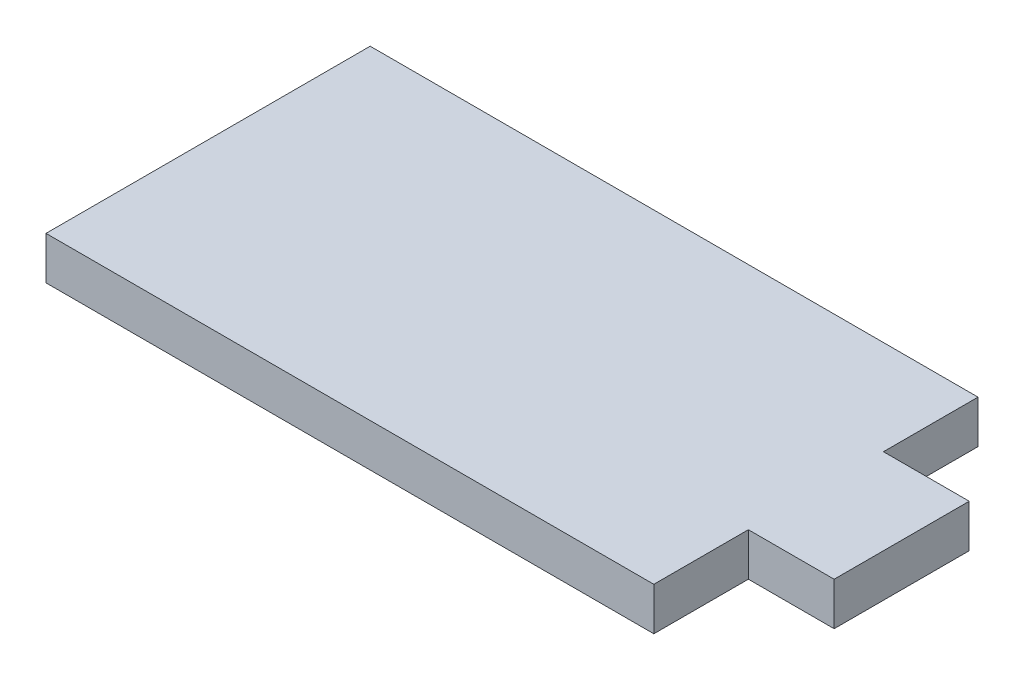
ISO-10303-21;
HEADER;
FILE_DESCRIPTION(('STEP AP214'),'2;1');
FILE_NAME('part.step','',(''),(''),'','','');
FILE_SCHEMA(('AUTOMOTIVE_DESIGN { 1 0 10303 214 1 1 1 1 }'));
ENDSEC;
DATA;
#1=APPLICATION_CONTEXT('core data for automotive mechanical design processes');
#2=APPLICATION_PROTOCOL_DEFINITION('international standard','automotive_design',2000,#1);
#3=PRODUCT_CONTEXT('',#1,'mechanical');
#4=PRODUCT('Part','Part','',(#3));
#5=PRODUCT_RELATED_PRODUCT_CATEGORY('part','',(#4));
#6=PRODUCT_DEFINITION_FORMATION('','',#4);
#7=PRODUCT_DEFINITION_CONTEXT('part definition',#1,'design');
#8=PRODUCT_DEFINITION('design','',#6,#7);
#9=PRODUCT_DEFINITION_SHAPE('','',#8);
#10=(LENGTH_UNIT() NAMED_UNIT(*) SI_UNIT(.MILLI.,.METRE.));
#11=(NAMED_UNIT(*) PLANE_ANGLE_UNIT() SI_UNIT($,.RADIAN.));
#12=(NAMED_UNIT(*) SI_UNIT($,.STERADIAN.) SOLID_ANGLE_UNIT());
#13=UNCERTAINTY_MEASURE_WITH_UNIT(LENGTH_MEASURE(1.E-05),#10,'distance_accuracy_value','');
#14=(GEOMETRIC_REPRESENTATION_CONTEXT(3) GLOBAL_UNCERTAINTY_ASSIGNED_CONTEXT((#13)) GLOBAL_UNIT_ASSIGNED_CONTEXT((#10,
#11,#12)) REPRESENTATION_CONTEXT('',''));
#15=CARTESIAN_POINT('',(0.,0.,0.));
#16=DIRECTION('',(0.,0.,1.));
#17=DIRECTION('',(1.,0.,0.));
#18=AXIS2_PLACEMENT_3D('',#15,#16,#17);
#19=CARTESIAN_POINT('',(-22.5,3.175,0.));
#20=DIRECTION('',(-1.,0.,0.));
#21=DIRECTION('',(0.,0.,1.));
#22=AXIS2_PLACEMENT_3D('',#19,#20,#21);
#23=PLANE('',#22);
#24=DIRECTION('',(0.,0.,-1.));
#25=VECTOR('',#24,1.);
#26=CARTESIAN_POINT('',(-22.5,0.,0.));
#27=LINE('',#26,#25);
#28=CARTESIAN_POINT('',(-22.5,0.,17.));
#29=VERTEX_POINT('',#28);
#30=CARTESIAN_POINT('',(-22.5,0.,-7.00000000000001));
#31=VERTEX_POINT('',#30);
#32=EDGE_CURVE('E127',#29,#31,#27,.T.);
#33=ORIENTED_EDGE('',*,*,#32,.F.);
#34=DIRECTION('',(0.,-1.,0.));
#35=VECTOR('',#34,1.);
#36=CARTESIAN_POINT('',(-22.5,3.175,17.));
#37=LINE('',#36,#35);
#38=CARTESIAN_POINT('',(-22.5,3.175,17.));
#39=VERTEX_POINT('',#38);
#40=EDGE_CURVE('E11',#39,#29,#37,.T.);
#41=ORIENTED_EDGE('',*,*,#40,.F.);
#42=DIRECTION('',(0.,0.,-1.));
#43=VECTOR('',#42,1.);
#44=CARTESIAN_POINT('',(-22.5,3.175,0.));
#45=LINE('',#44,#43);
#46=CARTESIAN_POINT('',(-22.5,3.175,-7.00000000000001));
#47=VERTEX_POINT('',#46);
#48=EDGE_CURVE('E147',#39,#47,#45,.T.);
#49=ORIENTED_EDGE('',*,*,#48,.T.);
#50=DIRECTION('',(0.,-1.,0.));
#51=VECTOR('',#50,1.);
#52=CARTESIAN_POINT('',(-22.5,3.175,-7.00000000000001));
#53=LINE('',#52,#51);
#54=EDGE_CURVE('E50',#47,#31,#53,.T.);
#55=ORIENTED_EDGE('',*,*,#54,.T.);
#56=EDGE_LOOP('',(#33,#41,#49,#55));
#57=FACE_BOUND('',#56,.T.);
#58=ADVANCED_FACE('F34',(#57),#23,.T.);
#59=CARTESIAN_POINT('',(0.,3.175,17.));
#60=DIRECTION('',(0.,0.,1.));
#61=DIRECTION('',(1.,0.,0.));
#62=AXIS2_PLACEMENT_3D('',#59,#60,#61);
#63=PLANE('',#62);
#64=DIRECTION('',(-1.,0.,0.));
#65=VECTOR('',#64,1.);
#66=CARTESIAN_POINT('',(0.,0.,17.));
#67=LINE('',#66,#65);
#68=CARTESIAN_POINT('',(22.5,0.,17.));
#69=VERTEX_POINT('',#68);
#70=EDGE_CURVE('E129',#69,#29,#67,.T.);
#71=ORIENTED_EDGE('',*,*,#70,.F.);
#72=DIRECTION('',(0.,-1.,0.));
#73=VECTOR('',#72,1.);
#74=CARTESIAN_POINT('',(22.5,3.175,17.));
#75=LINE('',#74,#73);
#76=CARTESIAN_POINT('',(22.5,3.175,17.));
#77=VERTEX_POINT('',#76);
#78=EDGE_CURVE('E42',#77,#69,#75,.T.);
#79=ORIENTED_EDGE('',*,*,#78,.F.);
#80=DIRECTION('',(-1.,0.,0.));
#81=VECTOR('',#80,1.);
#82=CARTESIAN_POINT('',(0.,3.175,17.));
#83=LINE('',#82,#81);
#84=EDGE_CURVE('E173',#77,#39,#83,.T.);
#85=ORIENTED_EDGE('',*,*,#84,.T.);
#86=ORIENTED_EDGE('',*,*,#40,.T.);
#87=EDGE_LOOP('',(#71,#79,#85,#86));
#88=FACE_BOUND('',#87,.T.);
#89=ADVANCED_FACE('F164',(#88),#63,.T.);
#90=CARTESIAN_POINT('',(22.5,3.175,0.));
#91=DIRECTION('',(1.,0.,0.));
#92=DIRECTION('',(0.,0.,-1.));
#93=AXIS2_PLACEMENT_3D('',#90,#91,#92);
#94=PLANE('',#93);
#95=DIRECTION('',(0.,0.,1.));
#96=VECTOR('',#95,1.);
#97=CARTESIAN_POINT('',(22.5,0.,0.));
#98=LINE('',#97,#96);
#99=CARTESIAN_POINT('',(22.5,0.,9.99999999999998));
#100=VERTEX_POINT('',#99);
#101=EDGE_CURVE('E132',#100,#69,#98,.T.);
#102=ORIENTED_EDGE('',*,*,#101,.F.);
#103=DIRECTION('',(0.,-1.,0.));
#104=VECTOR('',#103,1.);
#105=CARTESIAN_POINT('',(22.5,3.175,9.99999999999998));
#106=LINE('',#105,#104);
#107=CARTESIAN_POINT('',(22.5,3.175,9.99999999999998));
#108=VERTEX_POINT('',#107);
#109=EDGE_CURVE('E153',#108,#100,#106,.T.);
#110=ORIENTED_EDGE('',*,*,#109,.F.);
#111=DIRECTION('',(0.,0.,1.));
#112=VECTOR('',#111,1.);
#113=CARTESIAN_POINT('',(22.5,3.175,0.));
#114=LINE('',#113,#112);
#115=EDGE_CURVE('E160',#108,#77,#114,.T.);
#116=ORIENTED_EDGE('',*,*,#115,.T.);
#117=ORIENTED_EDGE('',*,*,#78,.T.);
#118=EDGE_LOOP('',(#102,#110,#116,#117));
#119=FACE_BOUND('',#118,.T.);
#120=ADVANCED_FACE('F158',(#119),#94,.T.);
#121=CARTESIAN_POINT('',(0.,3.175,9.99999999999998));
#122=DIRECTION('',(0.,0.,1.));
#123=DIRECTION('',(1.,0.,0.));
#124=AXIS2_PLACEMENT_3D('',#121,#122,#123);
#125=PLANE('',#124);
#126=DIRECTION('',(-1.,0.,0.));
#127=VECTOR('',#126,1.);
#128=CARTESIAN_POINT('',(0.,0.,9.99999999999998));
#129=LINE('',#128,#127);
#130=CARTESIAN_POINT('',(28.85,0.,9.99999999999998));
#131=VERTEX_POINT('',#130);
#132=EDGE_CURVE('E135',#131,#100,#129,.T.);
#133=ORIENTED_EDGE('',*,*,#132,.F.);
#134=DIRECTION('',(0.,-1.,0.));
#135=VECTOR('',#134,1.);
#136=CARTESIAN_POINT('',(28.85,3.175,9.99999999999998));
#137=LINE('',#136,#135);
#138=CARTESIAN_POINT('',(28.85,3.175,9.99999999999998));
#139=VERTEX_POINT('',#138);
#140=EDGE_CURVE('E151',#139,#131,#137,.T.);
#141=ORIENTED_EDGE('',*,*,#140,.F.);
#142=DIRECTION('',(-1.,0.,0.));
#143=VECTOR('',#142,1.);
#144=CARTESIAN_POINT('',(0.,3.175,9.99999999999998));
#145=LINE('',#144,#143);
#146=EDGE_CURVE('E172',#139,#108,#145,.T.);
#147=ORIENTED_EDGE('',*,*,#146,.T.);
#148=ORIENTED_EDGE('',*,*,#109,.T.);
#149=EDGE_LOOP('',(#133,#141,#147,#148));
#150=FACE_BOUND('',#149,.T.);
#151=ADVANCED_FACE('F170',(#150),#125,.T.);
#152=CARTESIAN_POINT('',(28.85,3.175,0.));
#153=DIRECTION('',(1.,0.,0.));
#154=DIRECTION('',(0.,0.,-1.));
#155=AXIS2_PLACEMENT_3D('',#152,#153,#154);
#156=PLANE('',#155);
#157=DIRECTION('',(0.,0.,1.));
#158=VECTOR('',#157,1.);
#159=CARTESIAN_POINT('',(28.85,0.,0.));
#160=LINE('',#159,#158);
#161=CARTESIAN_POINT('',(28.85,0.,0.));
#162=VERTEX_POINT('',#161);
#163=EDGE_CURVE('E138',#162,#131,#160,.T.);
#164=ORIENTED_EDGE('',*,*,#163,.F.);
#165=DIRECTION('',(0.,-1.,0.));
#166=VECTOR('',#165,1.);
#167=CARTESIAN_POINT('',(28.85,3.175,0.));
#168=LINE('',#167,#166);
#169=CARTESIAN_POINT('',(28.85,3.175,0.));
#170=VERTEX_POINT('',#169);
#171=EDGE_CURVE('E109',#170,#162,#168,.T.);
#172=ORIENTED_EDGE('',*,*,#171,.F.);
#173=DIRECTION('',(0.,0.,1.));
#174=VECTOR('',#173,1.);
#175=CARTESIAN_POINT('',(28.85,3.175,0.));
#176=LINE('',#175,#174);
#177=EDGE_CURVE('E119',#170,#139,#176,.T.);
#178=ORIENTED_EDGE('',*,*,#177,.T.);
#179=ORIENTED_EDGE('',*,*,#140,.T.);
#180=EDGE_LOOP('',(#164,#172,#178,#179));
#181=FACE_BOUND('',#180,.T.);
#182=ADVANCED_FACE('F179',(#181),#156,.T.);
#183=CARTESIAN_POINT('',(0.,3.175,0.));
#184=DIRECTION('',(0.,0.,-1.));
#185=DIRECTION('',(-1.,0.,0.));
#186=AXIS2_PLACEMENT_3D('',#183,#184,#185);
#187=PLANE('',#186);
#188=DIRECTION('',(1.,0.,0.));
#189=VECTOR('',#188,1.);
#190=CARTESIAN_POINT('',(0.,0.,0.));
#191=LINE('',#190,#189);
#192=CARTESIAN_POINT('',(22.5,0.,0.));
#193=VERTEX_POINT('',#192);
#194=EDGE_CURVE('E105',#193,#162,#191,.T.);
#195=ORIENTED_EDGE('',*,*,#194,.F.);
#196=DIRECTION('',(0.,-1.,0.));
#197=VECTOR('',#196,1.);
#198=CARTESIAN_POINT('',(22.5,3.175,0.));
#199=LINE('',#198,#197);
#200=CARTESIAN_POINT('',(22.5,3.175,0.));
#201=VERTEX_POINT('',#200);
#202=EDGE_CURVE('E100',#201,#193,#199,.T.);
#203=ORIENTED_EDGE('',*,*,#202,.F.);
#204=DIRECTION('',(1.,0.,0.));
#205=VECTOR('',#204,1.);
#206=CARTESIAN_POINT('',(0.,3.175,0.));
#207=LINE('',#206,#205);
#208=EDGE_CURVE('E103',#201,#170,#207,.T.);
#209=ORIENTED_EDGE('',*,*,#208,.T.);
#210=ORIENTED_EDGE('',*,*,#171,.T.);
#211=EDGE_LOOP('',(#195,#203,#209,#210));
#212=FACE_BOUND('',#211,.T.);
#213=ADVANCED_FACE('F102',(#212),#187,.T.);
#214=CARTESIAN_POINT('',(22.5,3.175,0.));
#215=DIRECTION('',(1.,0.,0.));
#216=DIRECTION('',(0.,0.,-1.));
#217=AXIS2_PLACEMENT_3D('',#214,#215,#216);
#218=PLANE('',#217);
#219=DIRECTION('',(0.,0.,1.));
#220=VECTOR('',#219,1.);
#221=CARTESIAN_POINT('',(22.5,0.,0.));
#222=LINE('',#221,#220);
#223=CARTESIAN_POINT('',(22.5,0.,-7.00000000000001));
#224=VERTEX_POINT('',#223);
#225=EDGE_CURVE('E142',#224,#193,#222,.T.);
#226=ORIENTED_EDGE('',*,*,#225,.F.);
#227=DIRECTION('',(0.,-1.,0.));
#228=VECTOR('',#227,1.);
#229=CARTESIAN_POINT('',(22.5,3.175,-7.00000000000001));
#230=LINE('',#229,#228);
#231=CARTESIAN_POINT('',(22.5,3.175,-7.00000000000001));
#232=VERTEX_POINT('',#231);
#233=EDGE_CURVE('E75',#232,#224,#230,.T.);
#234=ORIENTED_EDGE('',*,*,#233,.F.);
#235=DIRECTION('',(0.,0.,1.));
#236=VECTOR('',#235,1.);
#237=CARTESIAN_POINT('',(22.5,3.175,0.));
#238=LINE('',#237,#236);
#239=EDGE_CURVE('E116',#232,#201,#238,.T.);
#240=ORIENTED_EDGE('',*,*,#239,.T.);
#241=ORIENTED_EDGE('',*,*,#202,.T.);
#242=EDGE_LOOP('',(#226,#234,#240,#241));
#243=FACE_BOUND('',#242,.T.);
#244=ADVANCED_FACE('F121',(#243),#218,.T.);
#245=CARTESIAN_POINT('',(0.,3.175,-7.00000000000001));
#246=DIRECTION('',(0.,0.,-1.));
#247=DIRECTION('',(-1.,0.,0.));
#248=AXIS2_PLACEMENT_3D('',#245,#246,#247);
#249=PLANE('',#248);
#250=DIRECTION('',(1.,0.,0.));
#251=VECTOR('',#250,1.);
#252=CARTESIAN_POINT('',(0.,0.,-7.00000000000001));
#253=LINE('',#252,#251);
#254=EDGE_CURVE('E144',#31,#224,#253,.T.);
#255=ORIENTED_EDGE('',*,*,#254,.F.);
#256=ORIENTED_EDGE('',*,*,#54,.F.);
#257=DIRECTION('',(1.,0.,0.));
#258=VECTOR('',#257,1.);
#259=CARTESIAN_POINT('',(0.,3.175,-7.00000000000001));
#260=LINE('',#259,#258);
#261=EDGE_CURVE('E122',#47,#232,#260,.T.);
#262=ORIENTED_EDGE('',*,*,#261,.T.);
#263=ORIENTED_EDGE('',*,*,#233,.T.);
#264=EDGE_LOOP('',(#255,#256,#262,#263));
#265=FACE_BOUND('',#264,.T.);
#266=ADVANCED_FACE('F180',(#265),#249,.T.);
#267=CARTESIAN_POINT('',(0.,3.175,0.));
#268=DIRECTION('',(0.,1.,0.));
#269=DIRECTION('',(0.,0.,1.));
#270=AXIS2_PLACEMENT_3D('',#267,#268,#269);
#271=PLANE('',#270);
#272=ORIENTED_EDGE('',*,*,#48,.F.);
#273=ORIENTED_EDGE('',*,*,#84,.F.);
#274=ORIENTED_EDGE('',*,*,#115,.F.);
#275=ORIENTED_EDGE('',*,*,#146,.F.);
#276=ORIENTED_EDGE('',*,*,#177,.F.);
#277=ORIENTED_EDGE('',*,*,#208,.F.);
#278=ORIENTED_EDGE('',*,*,#239,.F.);
#279=ORIENTED_EDGE('',*,*,#261,.F.);
#280=EDGE_LOOP('',(#272,#273,#274,#275,#276,#277,#278,#279));
#281=FACE_BOUND('',#280,.T.);
#282=ADVANCED_FACE('F114',(#281),#271,.T.);
#283=CARTESIAN_POINT('',(0.,0.,0.));
#284=DIRECTION('',(0.,1.,0.));
#285=DIRECTION('',(0.,0.,1.));
#286=AXIS2_PLACEMENT_3D('',#283,#284,#285);
#287=PLANE('',#286);
#288=ORIENTED_EDGE('',*,*,#32,.T.);
#289=ORIENTED_EDGE('',*,*,#254,.T.);
#290=ORIENTED_EDGE('',*,*,#225,.T.);
#291=ORIENTED_EDGE('',*,*,#194,.T.);
#292=ORIENTED_EDGE('',*,*,#163,.T.);
#293=ORIENTED_EDGE('',*,*,#132,.T.);
#294=ORIENTED_EDGE('',*,*,#101,.T.);
#295=ORIENTED_EDGE('',*,*,#70,.T.);
#296=EDGE_LOOP('',(#288,#289,#290,#291,#292,#293,#294,#295));
#297=FACE_BOUND('',#296,.T.);
#298=ADVANCED_FACE('F166',(#297),#287,.F.);
#299=CLOSED_SHELL('',(#58,#89,#120,#151,#182,#213,#244,#266,#282,#298));
#300=MANIFOLD_SOLID_BREP('B2',#299);
#301=ADVANCED_BREP_SHAPE_REPRESENTATION('',(#18,#300),#14);
#302=SHAPE_DEFINITION_REPRESENTATION(#9,#301);
ENDSEC;
END-ISO-10303-21;
